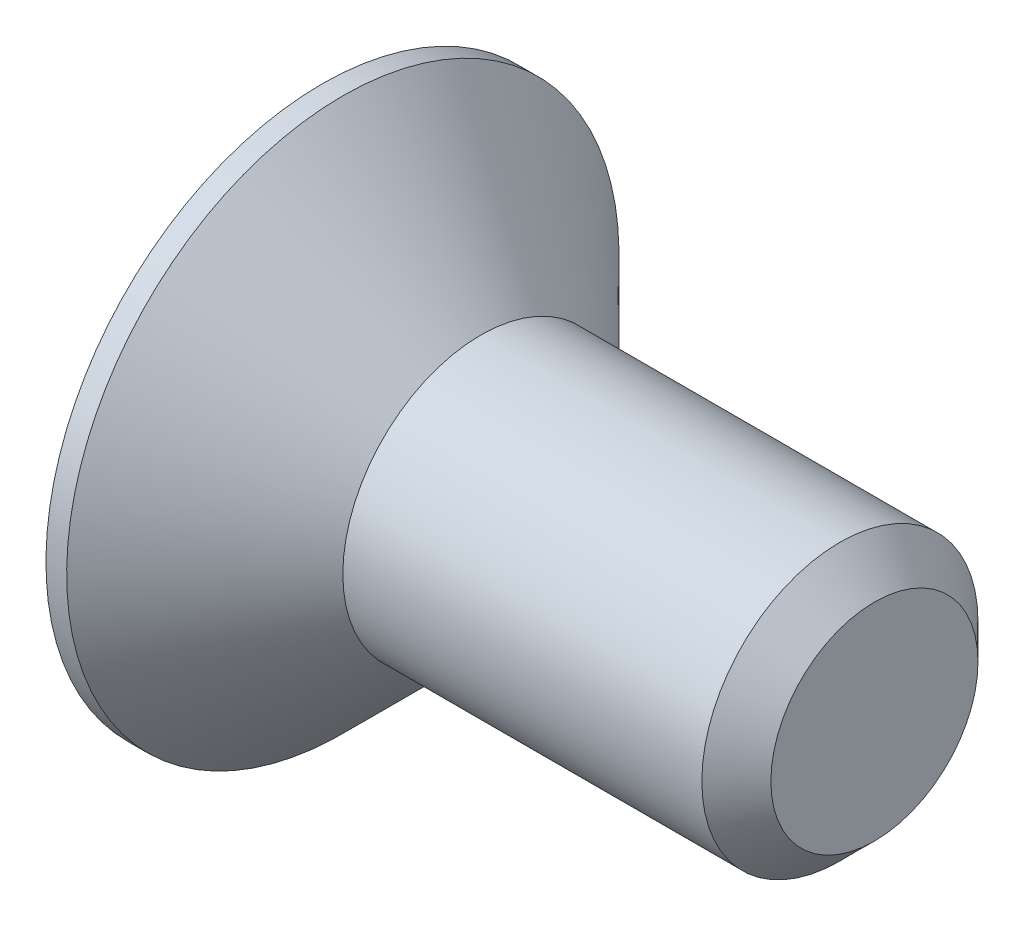
ISO-10303-21;
HEADER;
FILE_DESCRIPTION(('STEP AP214'),'2;1');
FILE_NAME('part.step','',(''),(''),'','','');
FILE_SCHEMA(('AUTOMOTIVE_DESIGN { 1 0 10303 214 1 1 1 1 }'));
ENDSEC;
DATA;
#1=APPLICATION_CONTEXT('core data for automotive mechanical design processes');
#2=APPLICATION_PROTOCOL_DEFINITION('international standard','automotive_design',2000,#1);
#3=PRODUCT_CONTEXT('',#1,'mechanical');
#4=PRODUCT('Part','Part','',(#3));
#5=PRODUCT_RELATED_PRODUCT_CATEGORY('part','',(#4));
#6=PRODUCT_DEFINITION_FORMATION('','',#4);
#7=PRODUCT_DEFINITION_CONTEXT('part definition',#1,'design');
#8=PRODUCT_DEFINITION('design','',#6,#7);
#9=PRODUCT_DEFINITION_SHAPE('','',#8);
#10=(LENGTH_UNIT() NAMED_UNIT(*) SI_UNIT(.MILLI.,.METRE.));
#11=(NAMED_UNIT(*) PLANE_ANGLE_UNIT() SI_UNIT($,.RADIAN.));
#12=(NAMED_UNIT(*) SI_UNIT($,.STERADIAN.) SOLID_ANGLE_UNIT());
#13=UNCERTAINTY_MEASURE_WITH_UNIT(LENGTH_MEASURE(1.E-05),#10,'distance_accuracy_value','');
#14=(GEOMETRIC_REPRESENTATION_CONTEXT(3) GLOBAL_UNCERTAINTY_ASSIGNED_CONTEXT((#13)) GLOBAL_UNIT_ASSIGNED_CONTEXT((#10,
#11,#12)) REPRESENTATION_CONTEXT('',''));
#15=CARTESIAN_POINT('',(0.,0.,0.));
#16=DIRECTION('',(0.,0.,1.));
#17=DIRECTION('',(1.,0.,0.));
#18=AXIS2_PLACEMENT_3D('',#15,#16,#17);
#19=CARTESIAN_POINT('',(0.,0.,0.));
#20=DIRECTION('',(-1.,0.,0.));
#21=DIRECTION('',(0.,-1.,0.));
#22=AXIS2_PLACEMENT_3D('',#19,#20,#21);
#23=PLANE('',#22);
#24=DIRECTION('',(0.,0.5,-0.866025403784439));
#25=VECTOR('',#24,1.);
#26=CARTESIAN_POINT('',(0.,0.721687836487033,1.25));
#27=LINE('',#26,#25);
#28=CARTESIAN_POINT('',(0.,0.721687836487033,1.25));
#29=VERTEX_POINT('',#28);
#30=CARTESIAN_POINT('',(0.,1.44337567297406,0.));
#31=VERTEX_POINT('',#30);
#32=EDGE_CURVE('E48',#29,#31,#27,.T.);
#33=ORIENTED_EDGE('',*,*,#32,.F.);
#34=DIRECTION('',(0.,1.,0.));
#35=VECTOR('',#34,1.);
#36=CARTESIAN_POINT('',(0.,-0.721687836487033,1.25));
#37=LINE('',#36,#35);
#38=CARTESIAN_POINT('',(0.,-0.721687836487033,1.25));
#39=VERTEX_POINT('',#38);
#40=EDGE_CURVE('E131',#39,#29,#37,.T.);
#41=ORIENTED_EDGE('',*,*,#40,.F.);
#42=DIRECTION('',(0.,0.5,0.866025403784439));
#43=VECTOR('',#42,1.);
#44=CARTESIAN_POINT('',(0.,-1.44337567297406,0.));
#45=LINE('',#44,#43);
#46=CARTESIAN_POINT('',(0.,-1.44337567297406,0.));
#47=VERTEX_POINT('',#46);
#48=EDGE_CURVE('E129',#47,#39,#45,.T.);
#49=ORIENTED_EDGE('',*,*,#48,.F.);
#50=DIRECTION('',(0.,-0.5,0.866025403784439));
#51=VECTOR('',#50,1.);
#52=CARTESIAN_POINT('',(0.,-0.721687836487032,-1.25));
#53=LINE('',#52,#51);
#54=CARTESIAN_POINT('',(0.,-0.721687836487032,-1.25));
#55=VERTEX_POINT('',#54);
#56=EDGE_CURVE('E96',#55,#47,#53,.T.);
#57=ORIENTED_EDGE('',*,*,#56,.F.);
#58=DIRECTION('',(0.,-1.,0.));
#59=VECTOR('',#58,1.);
#60=CARTESIAN_POINT('',(0.,0.721687836487033,-1.25));
#61=LINE('',#60,#59);
#62=CARTESIAN_POINT('',(0.,0.721687836487033,-1.25));
#63=VERTEX_POINT('',#62);
#64=EDGE_CURVE('E125',#63,#55,#61,.T.);
#65=ORIENTED_EDGE('',*,*,#64,.F.);
#66=DIRECTION('',(0.,-0.5,-0.866025403784439));
#67=VECTOR('',#66,1.);
#68=CARTESIAN_POINT('',(0.,1.44337567297406,0.));
#69=LINE('',#68,#67);
#70=EDGE_CURVE('E122',#31,#63,#69,.T.);
#71=ORIENTED_EDGE('',*,*,#70,.F.);
#72=EDGE_LOOP('',(#33,#41,#49,#57,#65,#71));
#73=FACE_BOUND('',#72,.T.);
#74=CARTESIAN_POINT('',(0.,0.,0.));
#75=DIRECTION('',(1.,0.,0.));
#76=DIRECTION('',(0.,1.,0.));
#77=AXIS2_PLACEMENT_3D('',#74,#75,#76);
#78=CIRCLE('',#77,4.);
#79=CARTESIAN_POINT('',(0.,4.,0.));
#80=VERTEX_POINT('',#79);
#81=EDGE_CURVE('E146',#80,#80,#78,.T.);
#82=ORIENTED_EDGE('',*,*,#81,.F.);
#83=EDGE_LOOP('',(#82));
#84=FACE_BOUND('',#83,.T.);
#85=ADVANCED_FACE('F33',(#73,#84),#23,.T.);
#86=CARTESIAN_POINT('',(8.,0.,0.));
#87=DIRECTION('',(1.,0.,0.));
#88=DIRECTION('',(0.,1.,0.));
#89=AXIS2_PLACEMENT_3D('',#86,#87,#88);
#90=CYLINDRICAL_SURFACE('',#89,4.);
#91=ORIENTED_EDGE('',*,*,#81,.T.);
#92=EDGE_LOOP('',(#91));
#93=FACE_BOUND('',#92,.T.);
#94=CARTESIAN_POINT('',(0.299999999999952,0.,0.));
#95=DIRECTION('',(1.,0.,0.));
#96=DIRECTION('',(0.,1.,0.));
#97=AXIS2_PLACEMENT_3D('',#94,#95,#96);
#98=CIRCLE('',#97,4.);
#99=CARTESIAN_POINT('',(0.299999999999952,4.,0.));
#100=VERTEX_POINT('',#99);
#101=EDGE_CURVE('E143',#100,#100,#98,.T.);
#102=ORIENTED_EDGE('',*,*,#101,.F.);
#103=EDGE_LOOP('',(#102));
#104=FACE_BOUND('',#103,.T.);
#105=ADVANCED_FACE('F166',(#93,#104),#90,.T.);
#106=CARTESIAN_POINT('',(2.3,0.,0.));
#107=DIRECTION('',(-1.,0.,0.));
#108=DIRECTION('',(0.,-1.,0.));
#109=AXIS2_PLACEMENT_3D('',#106,#107,#108);
#110=CONICAL_SURFACE('',#109,2.,0.785398163397437);
#111=ORIENTED_EDGE('',*,*,#101,.T.);
#112=EDGE_LOOP('',(#111));
#113=FACE_BOUND('',#112,.T.);
#114=CARTESIAN_POINT('',(2.3,0.,0.));
#115=DIRECTION('',(1.,0.,0.));
#116=DIRECTION('',(0.,1.,0.));
#117=AXIS2_PLACEMENT_3D('',#114,#115,#116);
#118=CIRCLE('',#117,2.);
#119=CARTESIAN_POINT('',(2.3,2.,0.));
#120=VERTEX_POINT('',#119);
#121=EDGE_CURVE('E135',#120,#120,#118,.T.);
#122=ORIENTED_EDGE('',*,*,#121,.F.);
#123=EDGE_LOOP('',(#122));
#124=FACE_BOUND('',#123,.T.);
#125=ADVANCED_FACE('F171',(#113,#124),#110,.T.);
#126=CARTESIAN_POINT('',(8.,0.,0.));
#127=DIRECTION('',(1.,0.,0.));
#128=DIRECTION('',(0.,1.,0.));
#129=AXIS2_PLACEMENT_3D('',#126,#127,#128);
#130=CYLINDRICAL_SURFACE('',#129,2.);
#131=CARTESIAN_POINT('',(7.5,0.,0.));
#132=DIRECTION('',(1.,0.,0.));
#133=DIRECTION('',(0.,1.,0.));
#134=AXIS2_PLACEMENT_3D('',#131,#132,#133);
#135=CIRCLE('',#134,2.);
#136=CARTESIAN_POINT('',(7.5,2.,0.));
#137=VERTEX_POINT('',#136);
#138=EDGE_CURVE('E11',#137,#137,#135,.F.);
#139=ORIENTED_EDGE('',*,*,#138,.T.);
#140=EDGE_LOOP('',(#139));
#141=FACE_BOUND('',#140,.T.);
#142=ORIENTED_EDGE('',*,*,#121,.T.);
#143=EDGE_LOOP('',(#142));
#144=FACE_BOUND('',#143,.T.);
#145=ADVANCED_FACE('F162',(#141,#144),#130,.T.);
#146=CARTESIAN_POINT('',(8.,2.,0.));
#147=DIRECTION('',(1.,0.,0.));
#148=DIRECTION('',(0.,1.,0.));
#149=AXIS2_PLACEMENT_3D('',#146,#147,#148);
#150=PLANE('',#149);
#151=CARTESIAN_POINT('',(8.,0.,0.));
#152=DIRECTION('',(1.,0.,0.));
#153=DIRECTION('',(0.,1.,0.));
#154=AXIS2_PLACEMENT_3D('',#151,#152,#153);
#155=CIRCLE('',#154,1.5);
#156=CARTESIAN_POINT('',(8.,1.5,0.));
#157=VERTEX_POINT('',#156);
#158=EDGE_CURVE('E41',#157,#157,#155,.T.);
#159=ORIENTED_EDGE('',*,*,#158,.T.);
#160=EDGE_LOOP('',(#159));
#161=FACE_BOUND('',#160,.T.);
#162=ADVANCED_FACE('F151',(#161),#150,.T.);
#163=CARTESIAN_POINT('',(8.,0.,0.));
#164=DIRECTION('',(-1.,0.,0.));
#165=DIRECTION('',(0.,-1.,0.));
#166=AXIS2_PLACEMENT_3D('',#163,#164,#165);
#167=CONICAL_SURFACE('',#166,1.5,0.785398163397447);
#168=ORIENTED_EDGE('',*,*,#138,.F.);
#169=EDGE_LOOP('',(#168));
#170=FACE_BOUND('',#169,.T.);
#171=ORIENTED_EDGE('',*,*,#158,.F.);
#172=EDGE_LOOP('',(#171));
#173=FACE_BOUND('',#172,.T.);
#174=ADVANCED_FACE('F35',(#170,#173),#167,.T.);
#175=CARTESIAN_POINT('',(1.8,0.721687836487032,1.25));
#176=DIRECTION('',(0.,0.866025403784438,0.5));
#177=DIRECTION('',(0.,-0.5,0.866025403784439));
#178=AXIS2_PLACEMENT_3D('',#175,#176,#177);
#179=PLANE('',#178);
#180=ORIENTED_EDGE('',*,*,#32,.T.);
#181=DIRECTION('',(-1.,0.,0.));
#182=VECTOR('',#181,1.);
#183=CARTESIAN_POINT('',(1.8,1.44337567297406,0.));
#184=LINE('',#183,#182);
#185=CARTESIAN_POINT('',(1.8,1.44337567297406,0.));
#186=VERTEX_POINT('',#185);
#187=EDGE_CURVE('E78',#186,#31,#184,.T.);
#188=ORIENTED_EDGE('',*,*,#187,.F.);
#189=DIRECTION('',(0.,0.5,-0.866025403784439));
#190=VECTOR('',#189,1.);
#191=CARTESIAN_POINT('',(1.8,0.721687836487032,1.25));
#192=LINE('',#191,#190);
#193=CARTESIAN_POINT('',(1.8,0.721687836487032,1.25));
#194=VERTEX_POINT('',#193);
#195=EDGE_CURVE('E133',#194,#186,#192,.T.);
#196=ORIENTED_EDGE('',*,*,#195,.F.);
#197=DIRECTION('',(-1.,0.,0.));
#198=VECTOR('',#197,1.);
#199=CARTESIAN_POINT('',(1.8,0.721687836487032,1.25));
#200=LINE('',#199,#198);
#201=EDGE_CURVE('E56',#194,#29,#200,.T.);
#202=ORIENTED_EDGE('',*,*,#201,.T.);
#203=EDGE_LOOP('',(#180,#188,#196,#202));
#204=FACE_BOUND('',#203,.T.);
#205=ADVANCED_FACE('F154',(#204),#179,.F.);
#206=CARTESIAN_POINT('',(1.8,-0.721687836487033,1.25));
#207=DIRECTION('',(0.,0.,1.));
#208=DIRECTION('',(0.,-1.,0.));
#209=AXIS2_PLACEMENT_3D('',#206,#207,#208);
#210=PLANE('',#209);
#211=ORIENTED_EDGE('',*,*,#40,.T.);
#212=ORIENTED_EDGE('',*,*,#201,.F.);
#213=DIRECTION('',(0.,1.,0.));
#214=VECTOR('',#213,1.);
#215=CARTESIAN_POINT('',(1.8,-0.721687836487033,1.25));
#216=LINE('',#215,#214);
#217=CARTESIAN_POINT('',(1.8,-0.721687836487033,1.25));
#218=VERTEX_POINT('',#217);
#219=EDGE_CURVE('E108',#218,#194,#216,.T.);
#220=ORIENTED_EDGE('',*,*,#219,.F.);
#221=DIRECTION('',(-1.,0.,0.));
#222=VECTOR('',#221,1.);
#223=CARTESIAN_POINT('',(1.8,-0.721687836487033,1.25));
#224=LINE('',#223,#222);
#225=EDGE_CURVE('E100',#218,#39,#224,.T.);
#226=ORIENTED_EDGE('',*,*,#225,.T.);
#227=EDGE_LOOP('',(#211,#212,#220,#226));
#228=FACE_BOUND('',#227,.T.);
#229=ADVANCED_FACE('F160',(#228),#210,.F.);
#230=CARTESIAN_POINT('',(1.8,-1.44337567297407,0.));
#231=DIRECTION('',(0.,-0.866025403784439,0.5));
#232=DIRECTION('',(0.,-0.5,-0.866025403784439));
#233=AXIS2_PLACEMENT_3D('',#230,#231,#232);
#234=PLANE('',#233);
#235=ORIENTED_EDGE('',*,*,#48,.T.);
#236=ORIENTED_EDGE('',*,*,#225,.F.);
#237=DIRECTION('',(0.,0.5,0.866025403784439));
#238=VECTOR('',#237,1.);
#239=CARTESIAN_POINT('',(1.8,-1.44337567297407,0.));
#240=LINE('',#239,#238);
#241=CARTESIAN_POINT('',(1.8,-1.44337567297407,0.));
#242=VERTEX_POINT('',#241);
#243=EDGE_CURVE('E104',#242,#218,#240,.T.);
#244=ORIENTED_EDGE('',*,*,#243,.F.);
#245=DIRECTION('',(-1.,0.,0.));
#246=VECTOR('',#245,1.);
#247=CARTESIAN_POINT('',(1.8,-1.44337567297407,0.));
#248=LINE('',#247,#246);
#249=EDGE_CURVE('E89',#242,#47,#248,.T.);
#250=ORIENTED_EDGE('',*,*,#249,.T.);
#251=EDGE_LOOP('',(#235,#236,#244,#250));
#252=FACE_BOUND('',#251,.T.);
#253=ADVANCED_FACE('F105',(#252),#234,.F.);
#254=CARTESIAN_POINT('',(1.8,-0.721687836487033,-1.25));
#255=DIRECTION('',(0.,-0.866025403784438,-0.5));
#256=DIRECTION('',(0.,0.5,-0.866025403784439));
#257=AXIS2_PLACEMENT_3D('',#254,#255,#256);
#258=PLANE('',#257);
#259=ORIENTED_EDGE('',*,*,#56,.T.);
#260=ORIENTED_EDGE('',*,*,#249,.F.);
#261=DIRECTION('',(0.,-0.5,0.866025403784439));
#262=VECTOR('',#261,1.);
#263=CARTESIAN_POINT('',(1.8,-0.721687836487033,-1.25));
#264=LINE('',#263,#262);
#265=CARTESIAN_POINT('',(1.8,-0.721687836487033,-1.25));
#266=VERTEX_POINT('',#265);
#267=EDGE_CURVE('E93',#266,#242,#264,.T.);
#268=ORIENTED_EDGE('',*,*,#267,.F.);
#269=DIRECTION('',(-1.,0.,0.));
#270=VECTOR('',#269,1.);
#271=CARTESIAN_POINT('',(1.8,-0.721687836487033,-1.25));
#272=LINE('',#271,#270);
#273=EDGE_CURVE('E101',#266,#55,#272,.T.);
#274=ORIENTED_EDGE('',*,*,#273,.T.);
#275=EDGE_LOOP('',(#259,#260,#268,#274));
#276=FACE_BOUND('',#275,.T.);
#277=ADVANCED_FACE('F91',(#276),#258,.F.);
#278=CARTESIAN_POINT('',(1.8,0.721687836487032,-1.25));
#279=DIRECTION('',(0.,0.,-1.));
#280=DIRECTION('',(-1.,0.,0.));
#281=AXIS2_PLACEMENT_3D('',#278,#279,#280);
#282=PLANE('',#281);
#283=ORIENTED_EDGE('',*,*,#64,.T.);
#284=ORIENTED_EDGE('',*,*,#273,.F.);
#285=DIRECTION('',(0.,-1.,0.));
#286=VECTOR('',#285,1.);
#287=CARTESIAN_POINT('',(1.8,0.721687836487032,-1.25));
#288=LINE('',#287,#286);
#289=CARTESIAN_POINT('',(1.8,0.721687836487032,-1.25));
#290=VERTEX_POINT('',#289);
#291=EDGE_CURVE('E114',#290,#266,#288,.T.);
#292=ORIENTED_EDGE('',*,*,#291,.F.);
#293=DIRECTION('',(-1.,0.,0.));
#294=VECTOR('',#293,1.);
#295=CARTESIAN_POINT('',(1.8,0.721687836487032,-1.25));
#296=LINE('',#295,#294);
#297=EDGE_CURVE('E138',#290,#63,#296,.T.);
#298=ORIENTED_EDGE('',*,*,#297,.T.);
#299=EDGE_LOOP('',(#283,#284,#292,#298));
#300=FACE_BOUND('',#299,.T.);
#301=ADVANCED_FACE('F185',(#300),#282,.F.);
#302=CARTESIAN_POINT('',(1.8,1.44337567297406,0.));
#303=DIRECTION('',(0.,0.866025403784439,-0.5));
#304=DIRECTION('',(0.,0.5,0.866025403784439));
#305=AXIS2_PLACEMENT_3D('',#302,#303,#304);
#306=PLANE('',#305);
#307=ORIENTED_EDGE('',*,*,#70,.T.);
#308=ORIENTED_EDGE('',*,*,#297,.F.);
#309=DIRECTION('',(0.,-0.5,-0.866025403784439));
#310=VECTOR('',#309,1.);
#311=CARTESIAN_POINT('',(1.8,1.44337567297406,0.));
#312=LINE('',#311,#310);
#313=EDGE_CURVE('E116',#186,#290,#312,.T.);
#314=ORIENTED_EDGE('',*,*,#313,.F.);
#315=ORIENTED_EDGE('',*,*,#187,.T.);
#316=EDGE_LOOP('',(#307,#308,#314,#315));
#317=FACE_BOUND('',#316,.T.);
#318=ADVANCED_FACE('F182',(#317),#306,.F.);
#319=CARTESIAN_POINT('',(1.8,0.,0.));
#320=DIRECTION('',(-1.,0.,0.));
#321=DIRECTION('',(0.,-1.,0.));
#322=AXIS2_PLACEMENT_3D('',#319,#320,#321);
#323=PLANE('',#322);
#324=ORIENTED_EDGE('',*,*,#195,.T.);
#325=ORIENTED_EDGE('',*,*,#313,.T.);
#326=ORIENTED_EDGE('',*,*,#291,.T.);
#327=ORIENTED_EDGE('',*,*,#267,.T.);
#328=ORIENTED_EDGE('',*,*,#243,.T.);
#329=ORIENTED_EDGE('',*,*,#219,.T.);
#330=EDGE_LOOP('',(#324,#325,#326,#327,#328,#329));
#331=FACE_BOUND('',#330,.T.);
#332=ADVANCED_FACE('F111',(#331),#323,.T.);
#333=CLOSED_SHELL('',(#85,#105,#125,#145,#162,#174,#205,#229,#253,#277,#301,#318,#332));
#334=MANIFOLD_SOLID_BREP('B2',#333);
#335=ADVANCED_BREP_SHAPE_REPRESENTATION('',(#18,#334),#14);
#336=SHAPE_DEFINITION_REPRESENTATION(#9,#335);
ENDSEC;
END-ISO-10303-21;
